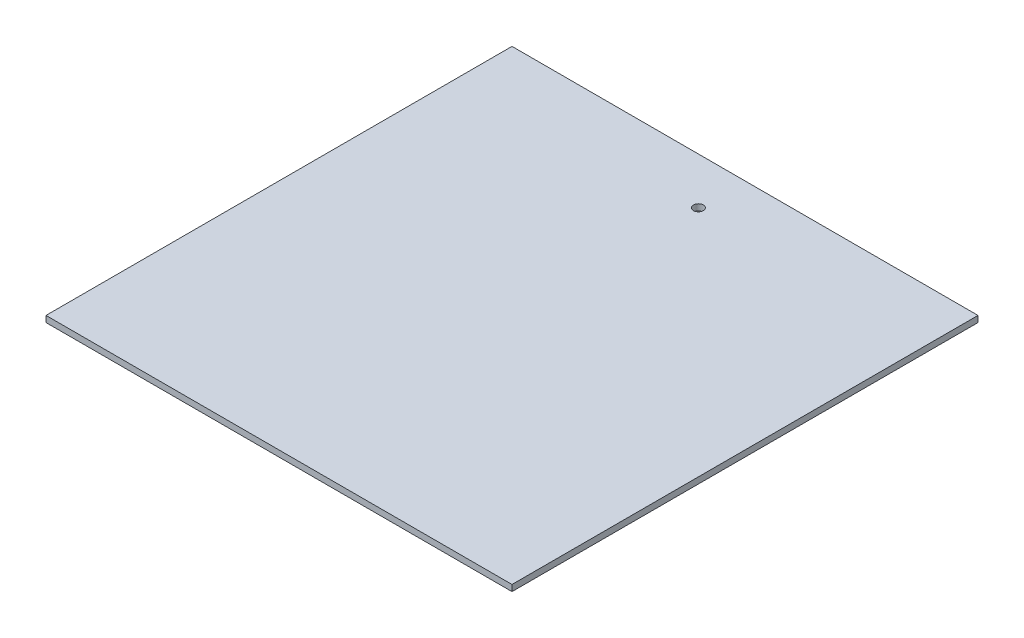
ISO-10303-21;
HEADER;
FILE_DESCRIPTION(('STEP AP214'),'2;1');
FILE_NAME('part.step','',(''),(''),'','','');
FILE_SCHEMA(('AUTOMOTIVE_DESIGN { 1 0 10303 214 1 1 1 1 }'));
ENDSEC;
DATA;
#1=APPLICATION_CONTEXT('core data for automotive mechanical design processes');
#2=APPLICATION_PROTOCOL_DEFINITION('international standard','automotive_design',2000,#1);
#3=PRODUCT_CONTEXT('',#1,'mechanical');
#4=PRODUCT('Part','Part','',(#3));
#5=PRODUCT_RELATED_PRODUCT_CATEGORY('part','',(#4));
#6=PRODUCT_DEFINITION_FORMATION('','',#4);
#7=PRODUCT_DEFINITION_CONTEXT('part definition',#1,'design');
#8=PRODUCT_DEFINITION('design','',#6,#7);
#9=PRODUCT_DEFINITION_SHAPE('','',#8);
#10=(LENGTH_UNIT() NAMED_UNIT(*) SI_UNIT(.MILLI.,.METRE.));
#11=(NAMED_UNIT(*) PLANE_ANGLE_UNIT() SI_UNIT($,.RADIAN.));
#12=(NAMED_UNIT(*) SI_UNIT($,.STERADIAN.) SOLID_ANGLE_UNIT());
#13=UNCERTAINTY_MEASURE_WITH_UNIT(LENGTH_MEASURE(1.E-05),#10,'distance_accuracy_value','');
#14=(GEOMETRIC_REPRESENTATION_CONTEXT(3) GLOBAL_UNCERTAINTY_ASSIGNED_CONTEXT((#13)) GLOBAL_UNIT_ASSIGNED_CONTEXT((#10,
#11,#12)) REPRESENTATION_CONTEXT('',''));
#15=CARTESIAN_POINT('',(0.,0.,0.));
#16=DIRECTION('',(0.,0.,1.));
#17=DIRECTION('',(1.,0.,0.));
#18=AXIS2_PLACEMENT_3D('',#15,#16,#17);
#19=CARTESIAN_POINT('',(95.25,2.54,95.25));
#20=DIRECTION('',(-1.,0.,0.));
#21=DIRECTION('',(0.,0.,1.));
#22=AXIS2_PLACEMENT_3D('',#19,#20,#21);
#23=PLANE('',#22);
#24=DIRECTION('',(0.,0.,-1.));
#25=VECTOR('',#24,1.);
#26=CARTESIAN_POINT('',(95.25,0.,95.25));
#27=LINE('',#26,#25);
#28=CARTESIAN_POINT('',(95.25,0.,95.25));
#29=VERTEX_POINT('',#28);
#30=CARTESIAN_POINT('',(95.25,0.,-95.25));
#31=VERTEX_POINT('',#30);
#32=EDGE_CURVE('E101',#29,#31,#27,.T.);
#33=ORIENTED_EDGE('',*,*,#32,.T.);
#34=DIRECTION('',(0.,-1.,0.));
#35=VECTOR('',#34,1.);
#36=CARTESIAN_POINT('',(95.25,2.54,-95.25));
#37=LINE('',#36,#35);
#38=CARTESIAN_POINT('',(95.25,2.54,-95.25));
#39=VERTEX_POINT('',#38);
#40=EDGE_CURVE('E11',#39,#31,#37,.T.);
#41=ORIENTED_EDGE('',*,*,#40,.F.);
#42=DIRECTION('',(0.,0.,-1.));
#43=VECTOR('',#42,1.);
#44=CARTESIAN_POINT('',(95.25,2.54,95.25));
#45=LINE('',#44,#43);
#46=CARTESIAN_POINT('',(95.25,2.54,95.25));
#47=VERTEX_POINT('',#46);
#48=EDGE_CURVE('E89',#47,#39,#45,.T.);
#49=ORIENTED_EDGE('',*,*,#48,.F.);
#50=DIRECTION('',(0.,-1.,0.));
#51=VECTOR('',#50,1.);
#52=CARTESIAN_POINT('',(95.25,2.54,95.25));
#53=LINE('',#52,#51);
#54=EDGE_CURVE('E97',#47,#29,#53,.T.);
#55=ORIENTED_EDGE('',*,*,#54,.T.);
#56=EDGE_LOOP('',(#33,#41,#49,#55));
#57=FACE_BOUND('',#56,.T.);
#58=ADVANCED_FACE('F38',(#57),#23,.F.);
#59=CARTESIAN_POINT('',(-95.25,2.54,-95.25));
#60=DIRECTION('',(0.,0.,1.));
#61=DIRECTION('',(1.,0.,0.));
#62=AXIS2_PLACEMENT_3D('',#59,#60,#61);
#63=PLANE('',#62);
#64=DIRECTION('',(-1.,0.,0.));
#65=VECTOR('',#64,1.);
#66=CARTESIAN_POINT('',(-95.25,0.,-95.25));
#67=LINE('',#66,#65);
#68=CARTESIAN_POINT('',(-95.25,0.,-95.25));
#69=VERTEX_POINT('',#68);
#70=EDGE_CURVE('E93',#31,#69,#67,.T.);
#71=ORIENTED_EDGE('',*,*,#70,.T.);
#72=DIRECTION('',(0.,-1.,0.));
#73=VECTOR('',#72,1.);
#74=CARTESIAN_POINT('',(-95.25,2.54,-95.25));
#75=LINE('',#74,#73);
#76=CARTESIAN_POINT('',(-95.25,2.54,-95.25));
#77=VERTEX_POINT('',#76);
#78=EDGE_CURVE('E46',#77,#69,#75,.T.);
#79=ORIENTED_EDGE('',*,*,#78,.F.);
#80=DIRECTION('',(-1.,0.,0.));
#81=VECTOR('',#80,1.);
#82=CARTESIAN_POINT('',(-95.25,2.54,-95.25));
#83=LINE('',#82,#81);
#84=EDGE_CURVE('E84',#39,#77,#83,.T.);
#85=ORIENTED_EDGE('',*,*,#84,.F.);
#86=ORIENTED_EDGE('',*,*,#40,.T.);
#87=EDGE_LOOP('',(#71,#79,#85,#86));
#88=FACE_BOUND('',#87,.T.);
#89=ADVANCED_FACE('F92',(#88),#63,.F.);
#90=CARTESIAN_POINT('',(-95.25,2.54,95.25));
#91=DIRECTION('',(1.,0.,0.));
#92=DIRECTION('',(0.,0.,-1.));
#93=AXIS2_PLACEMENT_3D('',#90,#91,#92);
#94=PLANE('',#93);
#95=DIRECTION('',(0.,0.,1.));
#96=VECTOR('',#95,1.);
#97=CARTESIAN_POINT('',(-95.25,0.,95.25));
#98=LINE('',#97,#96);
#99=CARTESIAN_POINT('',(-95.25,0.,95.25));
#100=VERTEX_POINT('',#99);
#101=EDGE_CURVE('E71',#69,#100,#98,.T.);
#102=ORIENTED_EDGE('',*,*,#101,.T.);
#103=DIRECTION('',(0.,-1.,0.));
#104=VECTOR('',#103,1.);
#105=CARTESIAN_POINT('',(-95.25,2.54,95.25));
#106=LINE('',#105,#104);
#107=CARTESIAN_POINT('',(-95.25,2.54,95.25));
#108=VERTEX_POINT('',#107);
#109=EDGE_CURVE('E94',#108,#100,#106,.T.);
#110=ORIENTED_EDGE('',*,*,#109,.F.);
#111=DIRECTION('',(0.,0.,1.));
#112=VECTOR('',#111,1.);
#113=CARTESIAN_POINT('',(-95.25,2.54,95.25));
#114=LINE('',#113,#112);
#115=EDGE_CURVE('E87',#77,#108,#114,.T.);
#116=ORIENTED_EDGE('',*,*,#115,.F.);
#117=ORIENTED_EDGE('',*,*,#78,.T.);
#118=EDGE_LOOP('',(#102,#110,#116,#117));
#119=FACE_BOUND('',#118,.T.);
#120=ADVANCED_FACE('F95',(#119),#94,.F.);
#121=CARTESIAN_POINT('',(-95.25,2.54,95.25));
#122=DIRECTION('',(0.,0.,-1.));
#123=DIRECTION('',(-1.,0.,0.));
#124=AXIS2_PLACEMENT_3D('',#121,#122,#123);
#125=PLANE('',#124);
#126=DIRECTION('',(1.,0.,0.));
#127=VECTOR('',#126,1.);
#128=CARTESIAN_POINT('',(-95.25,0.,95.25));
#129=LINE('',#128,#127);
#130=EDGE_CURVE('E77',#100,#29,#129,.T.);
#131=ORIENTED_EDGE('',*,*,#130,.T.);
#132=ORIENTED_EDGE('',*,*,#54,.F.);
#133=DIRECTION('',(1.,0.,0.));
#134=VECTOR('',#133,1.);
#135=CARTESIAN_POINT('',(-95.25,2.54,95.25));
#136=LINE('',#135,#134);
#137=EDGE_CURVE('E54',#108,#47,#136,.T.);
#138=ORIENTED_EDGE('',*,*,#137,.F.);
#139=ORIENTED_EDGE('',*,*,#109,.T.);
#140=EDGE_LOOP('',(#131,#132,#138,#139));
#141=FACE_BOUND('',#140,.T.);
#142=ADVANCED_FACE('F109',(#141),#125,.F.);
#143=CARTESIAN_POINT('',(0.,2.54,0.));
#144=DIRECTION('',(0.,-1.,0.));
#145=DIRECTION('',(0.,0.,-1.));
#146=AXIS2_PLACEMENT_3D('',#143,#144,#145);
#147=PLANE('',#146);
#148=CARTESIAN_POINT('',(0.000813672640945229,2.54,-76.1991863273571));
#149=DIRECTION('',(0.,1.,0.));
#150=DIRECTION('',(0.,0.,1.));
#151=AXIS2_PLACEMENT_3D('',#148,#149,#150);
#152=CIRCLE('',#151,2.032);
#153=CARTESIAN_POINT('',(0.000813672640945229,2.54,-74.1671863273571));
#154=VERTEX_POINT('',#153);
#155=EDGE_CURVE('E117',#154,#154,#152,.T.);
#156=ORIENTED_EDGE('',*,*,#155,.F.);
#157=EDGE_LOOP('',(#156));
#158=FACE_BOUND('',#157,.T.);
#159=ORIENTED_EDGE('',*,*,#48,.T.);
#160=ORIENTED_EDGE('',*,*,#84,.T.);
#161=ORIENTED_EDGE('',*,*,#115,.T.);
#162=ORIENTED_EDGE('',*,*,#137,.T.);
#163=EDGE_LOOP('',(#159,#160,#161,#162));
#164=FACE_BOUND('',#163,.T.);
#165=ADVANCED_FACE('F85',(#158,#164),#147,.F.);
#166=CARTESIAN_POINT('',(0.,0.,0.));
#167=DIRECTION('',(0.,-1.,0.));
#168=DIRECTION('',(0.,0.,-1.));
#169=AXIS2_PLACEMENT_3D('',#166,#167,#168);
#170=PLANE('',#169);
#171=CARTESIAN_POINT('',(0.000813672640945229,0.,-76.1991863273571));
#172=DIRECTION('',(0.,-1.,0.));
#173=DIRECTION('',(0.,0.,-1.));
#174=AXIS2_PLACEMENT_3D('',#171,#172,#173);
#175=CIRCLE('',#174,2.032);
#176=CARTESIAN_POINT('',(0.000813672640945229,0.,-78.2311863273572));
#177=VERTEX_POINT('',#176);
#178=EDGE_CURVE('E104',#177,#177,#175,.F.);
#179=ORIENTED_EDGE('',*,*,#178,.T.);
#180=EDGE_LOOP('',(#179));
#181=FACE_BOUND('',#180,.T.);
#182=ORIENTED_EDGE('',*,*,#32,.F.);
#183=ORIENTED_EDGE('',*,*,#130,.F.);
#184=ORIENTED_EDGE('',*,*,#101,.F.);
#185=ORIENTED_EDGE('',*,*,#70,.F.);
#186=EDGE_LOOP('',(#182,#183,#184,#185));
#187=FACE_BOUND('',#186,.T.);
#188=ADVANCED_FACE('F112',(#181,#187),#170,.T.);
#189=CARTESIAN_POINT('',(0.000813672640945229,-5.74736391748427,-76.1991863273571));
#190=DIRECTION('',(0.,1.,0.));
#191=DIRECTION('',(0.,0.,1.));
#192=AXIS2_PLACEMENT_3D('',#189,#190,#191);
#193=CYLINDRICAL_SURFACE('',#192,2.032);
#194=ORIENTED_EDGE('',*,*,#155,.T.);
#195=EDGE_LOOP('',(#194));
#196=FACE_BOUND('',#195,.T.);
#197=ORIENTED_EDGE('',*,*,#178,.F.);
#198=EDGE_LOOP('',(#197));
#199=FACE_BOUND('',#198,.T.);
#200=ADVANCED_FACE('F121',(#196,#199),#193,.F.);
#201=CLOSED_SHELL('',(#58,#89,#120,#142,#165,#188,#200));
#202=MANIFOLD_SOLID_BREP('B2',#201);
#203=ADVANCED_BREP_SHAPE_REPRESENTATION('',(#18,#202),#14);
#204=SHAPE_DEFINITION_REPRESENTATION(#9,#203);
ENDSEC;
END-ISO-10303-21;
